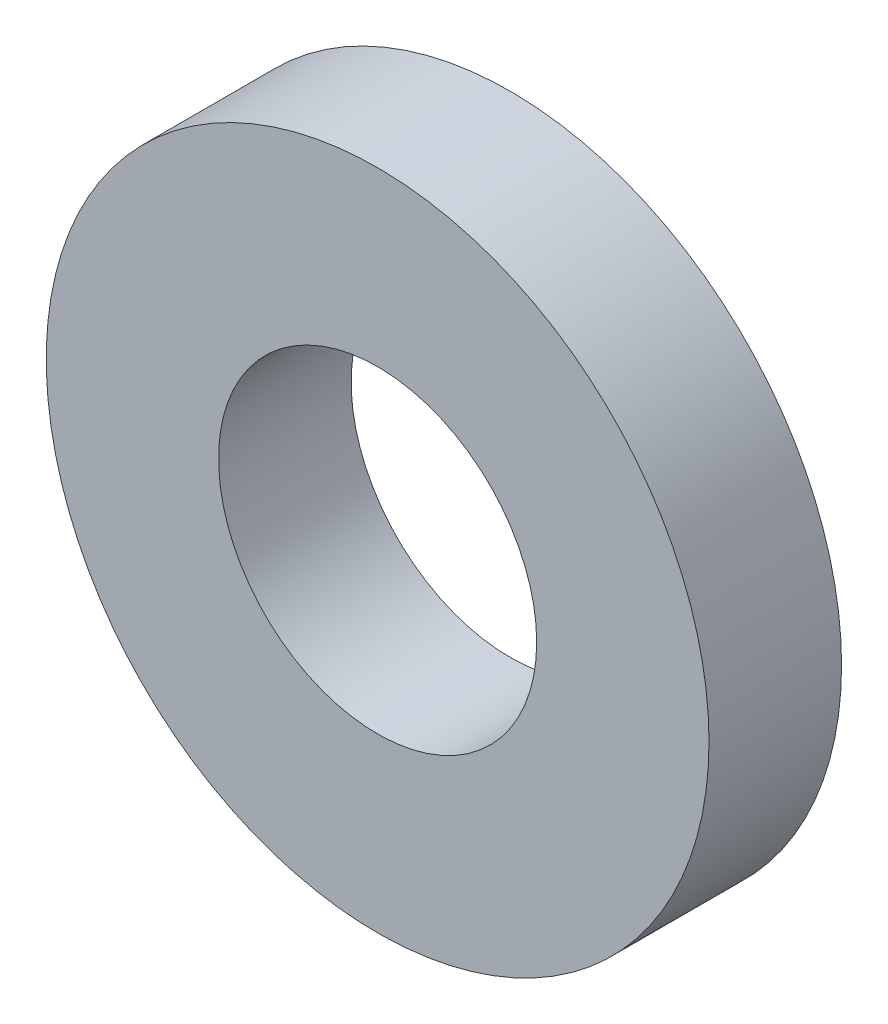
ISO-10303-21;
HEADER;
FILE_DESCRIPTION(('STEP AP214'),'2;1');
FILE_NAME('part.step','',(''),(''),'','','');
FILE_SCHEMA(('AUTOMOTIVE_DESIGN { 1 0 10303 214 1 1 1 1 }'));
ENDSEC;
DATA;
#1=APPLICATION_CONTEXT('core data for automotive mechanical design processes');
#2=APPLICATION_PROTOCOL_DEFINITION('international standard','automotive_design',2000,#1);
#3=PRODUCT_CONTEXT('',#1,'mechanical');
#4=PRODUCT('Part','Part','',(#3));
#5=PRODUCT_RELATED_PRODUCT_CATEGORY('part','',(#4));
#6=PRODUCT_DEFINITION_FORMATION('','',#4);
#7=PRODUCT_DEFINITION_CONTEXT('part definition',#1,'design');
#8=PRODUCT_DEFINITION('design','',#6,#7);
#9=PRODUCT_DEFINITION_SHAPE('','',#8);
#10=(LENGTH_UNIT() NAMED_UNIT(*) SI_UNIT(.MILLI.,.METRE.));
#11=(NAMED_UNIT(*) PLANE_ANGLE_UNIT() SI_UNIT($,.RADIAN.));
#12=(NAMED_UNIT(*) SI_UNIT($,.STERADIAN.) SOLID_ANGLE_UNIT());
#13=UNCERTAINTY_MEASURE_WITH_UNIT(LENGTH_MEASURE(1.E-05),#10,'distance_accuracy_value','');
#14=(GEOMETRIC_REPRESENTATION_CONTEXT(3) GLOBAL_UNCERTAINTY_ASSIGNED_CONTEXT((#13)) GLOBAL_UNIT_ASSIGNED_CONTEXT((#10,
#11,#12)) REPRESENTATION_CONTEXT('',''));
#15=CARTESIAN_POINT('',(0.,0.,0.));
#16=DIRECTION('',(0.,0.,1.));
#17=DIRECTION('',(1.,0.,0.));
#18=AXIS2_PLACEMENT_3D('',#15,#16,#17);
#19=CARTESIAN_POINT('',(0.,0.,1.27));
#20=DIRECTION('',(0.,0.,1.));
#21=DIRECTION('',(1.,0.,0.));
#22=AXIS2_PLACEMENT_3D('',#19,#20,#21);
#23=PLANE('',#22);
#24=CARTESIAN_POINT('',(0.,0.,1.27));
#25=DIRECTION('',(0.,0.,1.));
#26=DIRECTION('',(1.,0.,0.));
#27=AXIS2_PLACEMENT_3D('',#24,#25,#26);
#28=CIRCLE('',#27,3.175);
#29=CARTESIAN_POINT('',(3.175,0.,1.27));
#30=VERTEX_POINT('',#29);
#31=EDGE_CURVE('E10',#30,#30,#28,.T.);
#32=ORIENTED_EDGE('',*,*,#31,.T.);
#33=EDGE_LOOP('',(#32));
#34=FACE_BOUND('',#33,.T.);
#35=CARTESIAN_POINT('',(0.,0.,1.27));
#36=DIRECTION('',(0.,0.,1.));
#37=DIRECTION('',(1.,0.,0.));
#38=AXIS2_PLACEMENT_3D('',#35,#36,#37);
#39=CIRCLE('',#38,1.524);
#40=CARTESIAN_POINT('',(1.524,0.,1.27));
#41=VERTEX_POINT('',#40);
#42=EDGE_CURVE('E41',#41,#41,#39,.T.);
#43=ORIENTED_EDGE('',*,*,#42,.F.);
#44=EDGE_LOOP('',(#43));
#45=FACE_BOUND('',#44,.T.);
#46=ADVANCED_FACE('F30',(#34,#45),#23,.T.);
#47=CARTESIAN_POINT('',(0.,0.,0.));
#48=DIRECTION('',(0.,0.,1.));
#49=DIRECTION('',(1.,0.,0.));
#50=AXIS2_PLACEMENT_3D('',#47,#48,#49);
#51=PLANE('',#50);
#52=CARTESIAN_POINT('',(0.,0.,0.));
#53=DIRECTION('',(0.,0.,1.));
#54=DIRECTION('',(1.,0.,0.));
#55=AXIS2_PLACEMENT_3D('',#52,#53,#54);
#56=CIRCLE('',#55,3.175);
#57=CARTESIAN_POINT('',(3.175,0.,0.));
#58=VERTEX_POINT('',#57);
#59=EDGE_CURVE('E34',#58,#58,#56,.T.);
#60=ORIENTED_EDGE('',*,*,#59,.F.);
#61=EDGE_LOOP('',(#60));
#62=FACE_BOUND('',#61,.T.);
#63=CARTESIAN_POINT('',(0.,0.,0.));
#64=DIRECTION('',(0.,0.,1.));
#65=DIRECTION('',(1.,0.,0.));
#66=AXIS2_PLACEMENT_3D('',#63,#64,#65);
#67=CIRCLE('',#66,1.524);
#68=CARTESIAN_POINT('',(1.524,0.,0.));
#69=VERTEX_POINT('',#68);
#70=EDGE_CURVE('E43',#69,#69,#67,.T.);
#71=ORIENTED_EDGE('',*,*,#70,.T.);
#72=EDGE_LOOP('',(#71));
#73=FACE_BOUND('',#72,.T.);
#74=ADVANCED_FACE('F53',(#62,#73),#51,.F.);
#75=CARTESIAN_POINT('',(0.,0.,1.27));
#76=DIRECTION('',(0.,0.,-1.));
#77=DIRECTION('',(-1.,0.,0.));
#78=AXIS2_PLACEMENT_3D('',#75,#76,#77);
#79=CYLINDRICAL_SURFACE('',#78,3.175);
#80=ORIENTED_EDGE('',*,*,#31,.F.);
#81=EDGE_LOOP('',(#80));
#82=FACE_BOUND('',#81,.T.);
#83=ORIENTED_EDGE('',*,*,#59,.T.);
#84=EDGE_LOOP('',(#83));
#85=FACE_BOUND('',#84,.T.);
#86=ADVANCED_FACE('F32',(#82,#85),#79,.T.);
#87=CARTESIAN_POINT('',(0.,0.,1.27));
#88=DIRECTION('',(0.,0.,-1.));
#89=DIRECTION('',(-1.,0.,0.));
#90=AXIS2_PLACEMENT_3D('',#87,#88,#89);
#91=CYLINDRICAL_SURFACE('',#90,1.524);
#92=ORIENTED_EDGE('',*,*,#42,.T.);
#93=EDGE_LOOP('',(#92));
#94=FACE_BOUND('',#93,.T.);
#95=ORIENTED_EDGE('',*,*,#70,.F.);
#96=EDGE_LOOP('',(#95));
#97=FACE_BOUND('',#96,.T.);
#98=ADVANCED_FACE('F49',(#94,#97),#91,.F.);
#99=CLOSED_SHELL('',(#46,#74,#86,#98));
#100=MANIFOLD_SOLID_BREP('B2',#99);
#101=ADVANCED_BREP_SHAPE_REPRESENTATION('',(#18,#100),#14);
#102=SHAPE_DEFINITION_REPRESENTATION(#9,#101);
ENDSEC;
END-ISO-10303-21;
